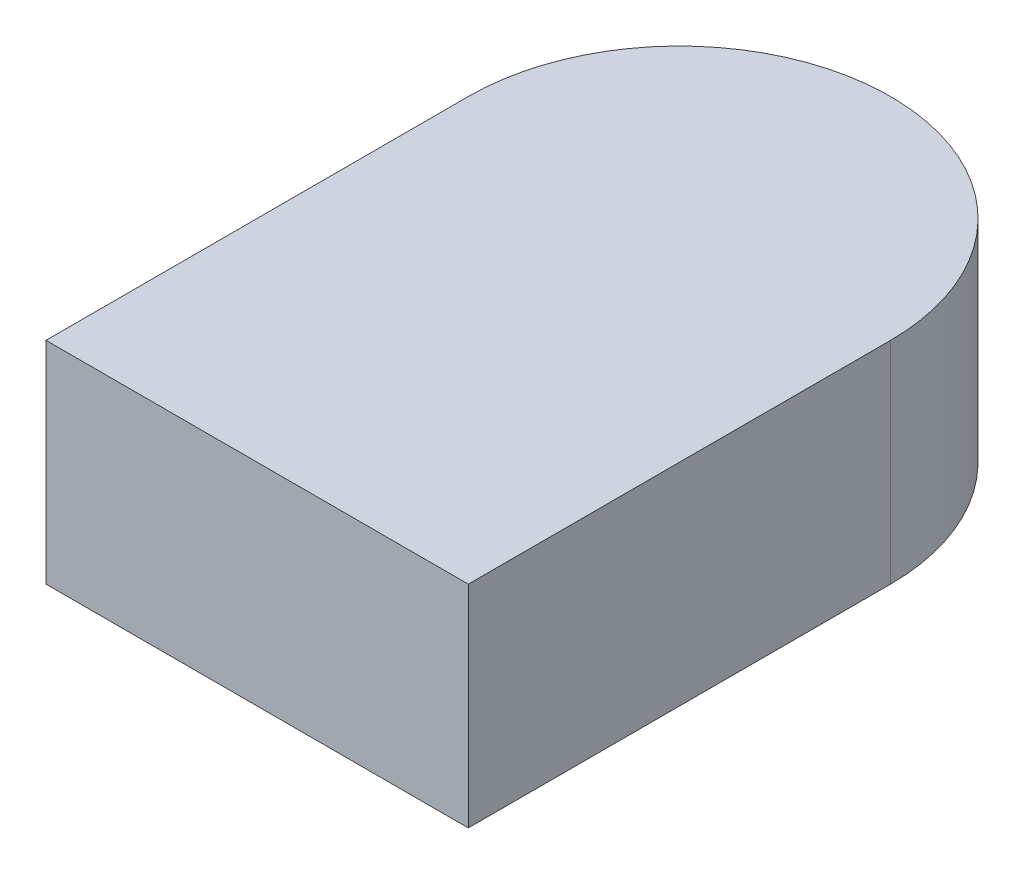
ISO-10303-21;
HEADER;
FILE_DESCRIPTION(('STEP AP214'),'2;1');
FILE_NAME('part.step','',(''),(''),'','','');
FILE_SCHEMA(('AUTOMOTIVE_DESIGN { 1 0 10303 214 1 1 1 1 }'));
ENDSEC;
DATA;
#1=APPLICATION_CONTEXT('core data for automotive mechanical design processes');
#2=APPLICATION_PROTOCOL_DEFINITION('international standard','automotive_design',2000,#1);
#3=PRODUCT_CONTEXT('',#1,'mechanical');
#4=PRODUCT('Part','Part','',(#3));
#5=PRODUCT_RELATED_PRODUCT_CATEGORY('part','',(#4));
#6=PRODUCT_DEFINITION_FORMATION('','',#4);
#7=PRODUCT_DEFINITION_CONTEXT('part definition',#1,'design');
#8=PRODUCT_DEFINITION('design','',#6,#7);
#9=PRODUCT_DEFINITION_SHAPE('','',#8);
#10=(LENGTH_UNIT() NAMED_UNIT(*) SI_UNIT(.MILLI.,.METRE.));
#11=(NAMED_UNIT(*) PLANE_ANGLE_UNIT() SI_UNIT($,.RADIAN.));
#12=(NAMED_UNIT(*) SI_UNIT($,.STERADIAN.) SOLID_ANGLE_UNIT());
#13=UNCERTAINTY_MEASURE_WITH_UNIT(LENGTH_MEASURE(1.E-05),#10,'distance_accuracy_value','');
#14=(GEOMETRIC_REPRESENTATION_CONTEXT(3) GLOBAL_UNCERTAINTY_ASSIGNED_CONTEXT((#13)) GLOBAL_UNIT_ASSIGNED_CONTEXT((#10,
#11,#12)) REPRESENTATION_CONTEXT('',''));
#15=CARTESIAN_POINT('',(0.,0.,0.));
#16=DIRECTION('',(0.,0.,1.));
#17=DIRECTION('',(1.,0.,0.));
#18=AXIS2_PLACEMENT_3D('',#15,#16,#17);
#19=CARTESIAN_POINT('',(0.,0.,0.));
#20=DIRECTION('',(0.,-1.,0.));
#21=DIRECTION('',(1.,0.,0.));
#22=AXIS2_PLACEMENT_3D('',#19,#20,#21);
#23=PLANE('',#22);
#24=CARTESIAN_POINT('',(0.,0.,2.05));
#25=DIRECTION('',(0.,-1.,0.));
#26=DIRECTION('',(-1.,0.,0.));
#27=AXIS2_PLACEMENT_3D('',#24,#25,#26);
#28=CIRCLE('',#27,0.1);
#29=CARTESIAN_POINT('',(-0.1,0.,2.05));
#30=VERTEX_POINT('',#29);
#31=CARTESIAN_POINT('',(0.1,0.,2.05));
#32=VERTEX_POINT('',#31);
#33=EDGE_CURVE('E11',#30,#32,#28,.T.);
#34=ORIENTED_EDGE('',*,*,#33,.T.);
#35=DIRECTION('',(0.,0.,1.));
#36=VECTOR('',#35,1.);
#37=CARTESIAN_POINT('',(0.1,0.,2.05));
#38=LINE('',#37,#36);
#39=CARTESIAN_POINT('',(0.1,0.,2.25));
#40=VERTEX_POINT('',#39);
#41=EDGE_CURVE('E25',#32,#40,#38,.T.);
#42=ORIENTED_EDGE('',*,*,#41,.T.);
#43=DIRECTION('',(-1.,0.,0.));
#44=VECTOR('',#43,1.);
#45=CARTESIAN_POINT('',(0.1,0.,2.25));
#46=LINE('',#45,#44);
#47=CARTESIAN_POINT('',(-0.1,0.,2.25));
#48=VERTEX_POINT('',#47);
#49=EDGE_CURVE('E73',#40,#48,#46,.T.);
#50=ORIENTED_EDGE('',*,*,#49,.T.);
#51=DIRECTION('',(0.,0.,-1.));
#52=VECTOR('',#51,1.);
#53=CARTESIAN_POINT('',(-0.1,0.,2.25));
#54=LINE('',#53,#52);
#55=EDGE_CURVE('E99',#48,#30,#54,.T.);
#56=ORIENTED_EDGE('',*,*,#55,.T.);
#57=EDGE_LOOP('',(#34,#42,#50,#56));
#58=FACE_BOUND('',#57,.T.);
#59=ADVANCED_FACE('F17',(#58),#23,.T.);
#60=CARTESIAN_POINT('',(-0.1,0.,2.25));
#61=DIRECTION('',(1.,0.,0.));
#62=DIRECTION('',(0.,0.,-1.));
#63=AXIS2_PLACEMENT_3D('',#60,#61,#62);
#64=PLANE('',#63);
#65=DIRECTION('',(0.,1.,0.));
#66=VECTOR('',#65,1.);
#67=CARTESIAN_POINT('',(-0.1,0.,2.25));
#68=LINE('',#67,#66);
#69=CARTESIAN_POINT('',(-0.1,0.1,2.25));
#70=VERTEX_POINT('',#69);
#71=EDGE_CURVE('E95',#48,#70,#68,.T.);
#72=ORIENTED_EDGE('',*,*,#71,.T.);
#73=DIRECTION('',(0.,0.,-1.));
#74=VECTOR('',#73,1.);
#75=CARTESIAN_POINT('',(-0.1,0.1,2.25));
#76=LINE('',#75,#74);
#77=CARTESIAN_POINT('',(-0.1,0.1,2.05));
#78=VERTEX_POINT('',#77);
#79=EDGE_CURVE('E68',#70,#78,#76,.T.);
#80=ORIENTED_EDGE('',*,*,#79,.T.);
#81=DIRECTION('',(0.,1.,0.));
#82=VECTOR('',#81,1.);
#83=CARTESIAN_POINT('',(-0.1,0.,2.05));
#84=LINE('',#83,#82);
#85=EDGE_CURVE('E87',#30,#78,#84,.T.);
#86=ORIENTED_EDGE('',*,*,#85,.F.);
#87=ORIENTED_EDGE('',*,*,#55,.F.);
#88=EDGE_LOOP('',(#72,#80,#86,#87));
#89=FACE_BOUND('',#88,.T.);
#90=ADVANCED_FACE('F113',(#89),#64,.F.);
#91=CARTESIAN_POINT('',(0.,0.,2.05));
#92=DIRECTION('',(0.,-1.,0.));
#93=DIRECTION('',(0.,0.,1.));
#94=AXIS2_PLACEMENT_3D('',#91,#92,#93);
#95=CYLINDRICAL_SURFACE('',#94,0.1);
#96=ORIENTED_EDGE('',*,*,#85,.T.);
#97=CARTESIAN_POINT('',(0.,0.1,2.05));
#98=DIRECTION('',(0.,-1.,0.));
#99=DIRECTION('',(-1.,0.,0.));
#100=AXIS2_PLACEMENT_3D('',#97,#98,#99);
#101=CIRCLE('',#100,0.1);
#102=CARTESIAN_POINT('',(0.1,0.1,2.05));
#103=VERTEX_POINT('',#102);
#104=EDGE_CURVE('E83',#78,#103,#101,.T.);
#105=ORIENTED_EDGE('',*,*,#104,.T.);
#106=DIRECTION('',(0.,1.,0.));
#107=VECTOR('',#106,1.);
#108=CARTESIAN_POINT('',(0.1,0.,2.05));
#109=LINE('',#108,#107);
#110=EDGE_CURVE('E60',#32,#103,#109,.T.);
#111=ORIENTED_EDGE('',*,*,#110,.F.);
#112=ORIENTED_EDGE('',*,*,#33,.F.);
#113=EDGE_LOOP('',(#96,#105,#111,#112));
#114=FACE_BOUND('',#113,.T.);
#115=ADVANCED_FACE('F115',(#114),#95,.T.);
#116=CARTESIAN_POINT('',(0.1,0.,2.05));
#117=DIRECTION('',(-1.,0.,0.));
#118=DIRECTION('',(0.,0.,1.));
#119=AXIS2_PLACEMENT_3D('',#116,#117,#118);
#120=PLANE('',#119);
#121=ORIENTED_EDGE('',*,*,#110,.T.);
#122=DIRECTION('',(0.,0.,1.));
#123=VECTOR('',#122,1.);
#124=CARTESIAN_POINT('',(0.1,0.1,2.05));
#125=LINE('',#124,#123);
#126=CARTESIAN_POINT('',(0.1,0.1,2.25));
#127=VERTEX_POINT('',#126);
#128=EDGE_CURVE('E53',#103,#127,#125,.T.);
#129=ORIENTED_EDGE('',*,*,#128,.T.);
#130=DIRECTION('',(0.,1.,0.));
#131=VECTOR('',#130,1.);
#132=CARTESIAN_POINT('',(0.1,0.,2.25));
#133=LINE('',#132,#131);
#134=EDGE_CURVE('E57',#40,#127,#133,.T.);
#135=ORIENTED_EDGE('',*,*,#134,.F.);
#136=ORIENTED_EDGE('',*,*,#41,.F.);
#137=EDGE_LOOP('',(#121,#129,#135,#136));
#138=FACE_BOUND('',#137,.T.);
#139=ADVANCED_FACE('F55',(#138),#120,.F.);
#140=CARTESIAN_POINT('',(0.1,0.,2.25));
#141=DIRECTION('',(0.,0.,-1.));
#142=DIRECTION('',(-1.,0.,0.));
#143=AXIS2_PLACEMENT_3D('',#140,#141,#142);
#144=PLANE('',#143);
#145=ORIENTED_EDGE('',*,*,#134,.T.);
#146=DIRECTION('',(-1.,0.,0.));
#147=VECTOR('',#146,1.);
#148=CARTESIAN_POINT('',(0.1,0.1,2.25));
#149=LINE('',#148,#147);
#150=EDGE_CURVE('E66',#127,#70,#149,.T.);
#151=ORIENTED_EDGE('',*,*,#150,.T.);
#152=ORIENTED_EDGE('',*,*,#71,.F.);
#153=ORIENTED_EDGE('',*,*,#49,.F.);
#154=EDGE_LOOP('',(#145,#151,#152,#153));
#155=FACE_BOUND('',#154,.T.);
#156=ADVANCED_FACE('F72',(#155),#144,.F.);
#157=CARTESIAN_POINT('',(0.,0.1,0.));
#158=DIRECTION('',(0.,-1.,0.));
#159=DIRECTION('',(1.,0.,0.));
#160=AXIS2_PLACEMENT_3D('',#157,#158,#159);
#161=PLANE('',#160);
#162=ORIENTED_EDGE('',*,*,#150,.F.);
#163=ORIENTED_EDGE('',*,*,#128,.F.);
#164=ORIENTED_EDGE('',*,*,#104,.F.);
#165=ORIENTED_EDGE('',*,*,#79,.F.);
#166=EDGE_LOOP('',(#162,#163,#164,#165));
#167=FACE_BOUND('',#166,.T.);
#168=ADVANCED_FACE('F67',(#167),#161,.F.);
#169=CLOSED_SHELL('',(#59,#90,#115,#139,#156,#168));
#170=MANIFOLD_SOLID_BREP('B1',#169);
#171=ADVANCED_BREP_SHAPE_REPRESENTATION('',(#18,#170),#14);
#172=SHAPE_DEFINITION_REPRESENTATION(#9,#171);
ENDSEC;
END-ISO-10303-21;
